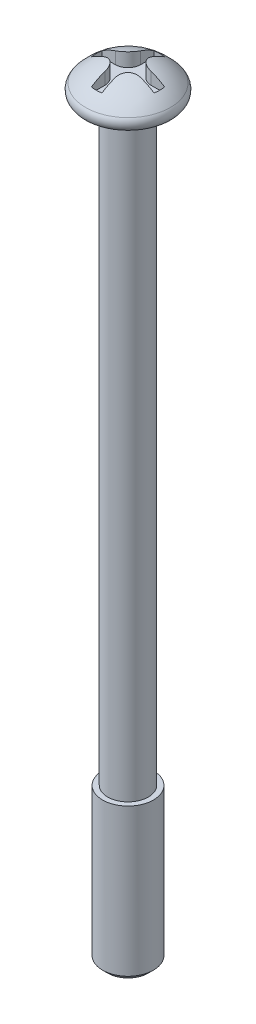
ISO-10303-21;
HEADER;
FILE_DESCRIPTION(('STEP AP214'),'2;1');
FILE_NAME('part.step','',(''),(''),'','','');
FILE_SCHEMA(('AUTOMOTIVE_DESIGN { 1 0 10303 214 1 1 1 1 }'));
ENDSEC;
DATA;
#1=APPLICATION_CONTEXT('core data for automotive mechanical design processes');
#2=APPLICATION_PROTOCOL_DEFINITION('international standard','automotive_design',2000,#1);
#3=PRODUCT_CONTEXT('',#1,'mechanical');
#4=PRODUCT('Part','Part','',(#3));
#5=PRODUCT_RELATED_PRODUCT_CATEGORY('part','',(#4));
#6=PRODUCT_DEFINITION_FORMATION('','',#4);
#7=PRODUCT_DEFINITION_CONTEXT('part definition',#1,'design');
#8=PRODUCT_DEFINITION('design','',#6,#7);
#9=PRODUCT_DEFINITION_SHAPE('','',#8);
#10=(LENGTH_UNIT() NAMED_UNIT(*) SI_UNIT(.MILLI.,.METRE.));
#11=(NAMED_UNIT(*) PLANE_ANGLE_UNIT() SI_UNIT($,.RADIAN.));
#12=(NAMED_UNIT(*) SI_UNIT($,.STERADIAN.) SOLID_ANGLE_UNIT());
#13=UNCERTAINTY_MEASURE_WITH_UNIT(LENGTH_MEASURE(1.E-05),#10,'distance_accuracy_value','');
#14=(GEOMETRIC_REPRESENTATION_CONTEXT(3) GLOBAL_UNCERTAINTY_ASSIGNED_CONTEXT((#13)) GLOBAL_UNIT_ASSIGNED_CONTEXT((#10,
#11,#12)) REPRESENTATION_CONTEXT('',''));
#15=CARTESIAN_POINT('',(0.,0.,0.));
#16=DIRECTION('',(0.,0.,1.));
#17=DIRECTION('',(1.,0.,0.));
#18=AXIS2_PLACEMENT_3D('',#15,#16,#17);
#19=CARTESIAN_POINT('',(0.,0.6,0.));
#20=DIRECTION('',(0.,-1.,0.));
#21=DIRECTION('',(0.,0.,-1.));
#22=AXIS2_PLACEMENT_3D('',#19,#20,#21);
#23=PLANE('',#22);
#24=DIRECTION('',(0.,0.,1.));
#25=VECTOR('',#24,1.);
#26=CARTESIAN_POINT('',(-0.2071067811865,0.6,1.232723318992));
#27=LINE('',#26,#25);
#28=CARTESIAN_POINT('',(-0.2071067811865,0.6,0.7071067811865));
#29=VERTEX_POINT('',#28);
#30=CARTESIAN_POINT('',(-0.2071067811865,0.6,1.23272331899198));
#31=VERTEX_POINT('',#30);
#32=EDGE_CURVE('E161',#29,#31,#27,.T.);
#33=ORIENTED_EDGE('',*,*,#32,.T.);
#34=CARTESIAN_POINT('',(0.,0.6,0.));
#35=DIRECTION('',(0.,-1.,0.));
#36=DIRECTION('',(0.,0.,-1.));
#37=AXIS2_PLACEMENT_3D('',#34,#35,#36);
#38=CIRCLE('',#37,1.25);
#39=CARTESIAN_POINT('',(0.207106781186497,0.6,1.23272331899197));
#40=VERTEX_POINT('',#39);
#41=EDGE_CURVE('E243',#31,#40,#38,.F.);
#42=ORIENTED_EDGE('',*,*,#41,.T.);
#43=DIRECTION('',(0.,0.,-1.));
#44=VECTOR('',#43,1.);
#45=CARTESIAN_POINT('',(0.2071067811865,0.6,0.7071067811865));
#46=LINE('',#45,#44);
#47=CARTESIAN_POINT('',(0.2071067811865,0.6,0.7071067811865));
#48=VERTEX_POINT('',#47);
#49=EDGE_CURVE('E165',#40,#48,#46,.T.);
#50=ORIENTED_EDGE('',*,*,#49,.T.);
#51=CARTESIAN_POINT('',(0.7071067811865,0.6,0.7071067811865));
#52=DIRECTION('',(0.,-1.,0.));
#53=DIRECTION('',(0.,0.,-1.));
#54=AXIS2_PLACEMENT_3D('',#51,#52,#53);
#55=CIRCLE('',#54,0.5);
#56=CARTESIAN_POINT('',(0.7071067811865,0.6,0.2071067811865));
#57=VERTEX_POINT('',#56);
#58=EDGE_CURVE('E168',#57,#48,#55,.F.);
#59=ORIENTED_EDGE('',*,*,#58,.F.);
#60=DIRECTION('',(1.,0.,0.));
#61=VECTOR('',#60,1.);
#62=CARTESIAN_POINT('',(1.232723318992,0.6,0.2071067811865));
#63=LINE('',#62,#61);
#64=CARTESIAN_POINT('',(1.23272331899198,0.6,0.2071067811865));
#65=VERTEX_POINT('',#64);
#66=EDGE_CURVE('E169',#57,#65,#63,.T.);
#67=ORIENTED_EDGE('',*,*,#66,.T.);
#68=CARTESIAN_POINT('',(0.,0.6,0.));
#69=DIRECTION('',(0.,-1.,0.));
#70=DIRECTION('',(0.,0.,-1.));
#71=AXIS2_PLACEMENT_3D('',#68,#69,#70);
#72=CIRCLE('',#71,1.25);
#73=CARTESIAN_POINT('',(1.23272331899197,0.6,-0.207106781186497));
#74=VERTEX_POINT('',#73);
#75=EDGE_CURVE('E254',#65,#74,#72,.F.);
#76=ORIENTED_EDGE('',*,*,#75,.T.);
#77=DIRECTION('',(-1.,0.,0.));
#78=VECTOR('',#77,1.);
#79=CARTESIAN_POINT('',(0.7071067811865,0.6,-0.2071067811865));
#80=LINE('',#79,#78);
#81=CARTESIAN_POINT('',(0.7071067811865,0.6,-0.2071067811865));
#82=VERTEX_POINT('',#81);
#83=EDGE_CURVE('E174',#74,#82,#80,.T.);
#84=ORIENTED_EDGE('',*,*,#83,.T.);
#85=CARTESIAN_POINT('',(0.7071067811865,0.6,-0.7071067811865));
#86=DIRECTION('',(0.,-1.,0.));
#87=DIRECTION('',(0.,0.,-1.));
#88=AXIS2_PLACEMENT_3D('',#85,#86,#87);
#89=CIRCLE('',#88,0.5);
#90=CARTESIAN_POINT('',(0.2071067811865,0.6,-0.7071067811865));
#91=VERTEX_POINT('',#90);
#92=EDGE_CURVE('E177',#91,#82,#89,.F.);
#93=ORIENTED_EDGE('',*,*,#92,.F.);
#94=DIRECTION('',(0.,0.,-1.));
#95=VECTOR('',#94,1.);
#96=CARTESIAN_POINT('',(0.2071067811865,0.6,-1.232723318992));
#97=LINE('',#96,#95);
#98=CARTESIAN_POINT('',(0.2071067811865,0.6,-1.23272331899198));
#99=VERTEX_POINT('',#98);
#100=EDGE_CURVE('E179',#91,#99,#97,.T.);
#101=ORIENTED_EDGE('',*,*,#100,.T.);
#102=CARTESIAN_POINT('',(0.,0.6,0.));
#103=DIRECTION('',(0.,-1.,0.));
#104=DIRECTION('',(0.,0.,-1.));
#105=AXIS2_PLACEMENT_3D('',#102,#103,#104);
#106=CIRCLE('',#105,1.25);
#107=CARTESIAN_POINT('',(-0.207106781186498,0.6,-1.23272331899197));
#108=VERTEX_POINT('',#107);
#109=EDGE_CURVE('E137',#99,#108,#106,.F.);
#110=ORIENTED_EDGE('',*,*,#109,.T.);
#111=DIRECTION('',(0.,0.,1.));
#112=VECTOR('',#111,1.);
#113=CARTESIAN_POINT('',(-0.2071067811865,0.6,-0.7071067811865));
#114=LINE('',#113,#112);
#115=CARTESIAN_POINT('',(-0.2071067811865,0.6,-0.7071067811865));
#116=VERTEX_POINT('',#115);
#117=EDGE_CURVE('E133',#108,#116,#114,.T.);
#118=ORIENTED_EDGE('',*,*,#117,.T.);
#119=CARTESIAN_POINT('',(-0.7071067811865,0.6,-0.7071067811865));
#120=DIRECTION('',(0.,-1.,0.));
#121=DIRECTION('',(0.,0.,-1.));
#122=AXIS2_PLACEMENT_3D('',#119,#120,#121);
#123=CIRCLE('',#122,0.5);
#124=CARTESIAN_POINT('',(-0.7071067811865,0.6,-0.2071067811865));
#125=VERTEX_POINT('',#124);
#126=EDGE_CURVE('E20',#125,#116,#123,.F.);
#127=ORIENTED_EDGE('',*,*,#126,.F.);
#128=DIRECTION('',(-1.,0.,0.));
#129=VECTOR('',#128,1.);
#130=CARTESIAN_POINT('',(-1.232723318992,0.6,-0.2071067811865));
#131=LINE('',#130,#129);
#132=CARTESIAN_POINT('',(-1.23272331899197,0.6,-0.207106781186497));
#133=VERTEX_POINT('',#132);
#134=EDGE_CURVE('E128',#125,#133,#131,.T.);
#135=ORIENTED_EDGE('',*,*,#134,.T.);
#136=CARTESIAN_POINT('',(0.,0.6,0.));
#137=DIRECTION('',(0.,-1.,0.));
#138=DIRECTION('',(0.,0.,-1.));
#139=AXIS2_PLACEMENT_3D('',#136,#137,#138);
#140=CIRCLE('',#139,1.25);
#141=CARTESIAN_POINT('',(-1.23272331899198,0.6,0.2071067811865));
#142=VERTEX_POINT('',#141);
#143=EDGE_CURVE('E251',#133,#142,#140,.F.);
#144=ORIENTED_EDGE('',*,*,#143,.T.);
#145=DIRECTION('',(1.,0.,0.));
#146=VECTOR('',#145,1.);
#147=CARTESIAN_POINT('',(-0.7071067811865,0.6,0.2071067811865));
#148=LINE('',#147,#146);
#149=CARTESIAN_POINT('',(-0.7071067811865,0.6,0.2071067811865));
#150=VERTEX_POINT('',#149);
#151=EDGE_CURVE('E158',#142,#150,#148,.T.);
#152=ORIENTED_EDGE('',*,*,#151,.T.);
#153=CARTESIAN_POINT('',(-0.7071067811865,0.6,0.7071067811865));
#154=DIRECTION('',(0.,-1.,0.));
#155=DIRECTION('',(0.,0.,-1.));
#156=AXIS2_PLACEMENT_3D('',#153,#154,#155);
#157=CIRCLE('',#156,0.5);
#158=EDGE_CURVE('E237',#29,#150,#157,.F.);
#159=ORIENTED_EDGE('',*,*,#158,.F.);
#160=EDGE_LOOP('',(#33,#42,#50,#59,#67,#76,#84,#93,#101,#110,#118,#127,#135,#144,#152,#159));
#161=FACE_BOUND('',#160,.T.);
#162=ADVANCED_FACE('F17',(#161),#23,.F.);
#163=CARTESIAN_POINT('',(0.,-29.5,0.));
#164=DIRECTION('',(0.,-1.,0.));
#165=DIRECTION('',(0.,0.,-1.));
#166=AXIS2_PLACEMENT_3D('',#163,#164,#165);
#167=PLANE('',#166);
#168=CARTESIAN_POINT('',(0.,-29.4999999999845,0.));
#169=DIRECTION('',(0.,1.,0.));
#170=DIRECTION('',(0.,0.,1.));
#171=AXIS2_PLACEMENT_3D('',#168,#169,#170);
#172=CIRCLE('',#171,0.800000000026557);
#173=CARTESIAN_POINT('',(0.,-29.4999999999845,0.800000000026557));
#174=VERTEX_POINT('',#173);
#175=EDGE_CURVE('E234',#174,#174,#172,.T.);
#176=ORIENTED_EDGE('',*,*,#175,.F.);
#177=EDGE_LOOP('',(#176));
#178=FACE_BOUND('',#177,.T.);
#179=ADVANCED_FACE('F298',(#178),#167,.T.);
#180=CARTESIAN_POINT('',(-1.232723318992,0.6,-0.2071067811865));
#181=DIRECTION('',(0.,0.,-1.));
#182=DIRECTION('',(-1.,0.,0.));
#183=AXIS2_PLACEMENT_3D('',#180,#181,#182);
#184=PLANE('',#183);
#185=ORIENTED_EDGE('',*,*,#134,.F.);
#186=DIRECTION('',(0.,-1.,0.));
#187=VECTOR('',#186,1.);
#188=CARTESIAN_POINT('',(-0.7071067811865,0.6,-0.2071067811865));
#189=LINE('',#188,#187);
#190=CARTESIAN_POINT('',(-0.707106781186498,1.072946400944,-0.2071067811865));
#191=VERTEX_POINT('',#190);
#192=EDGE_CURVE('E147',#191,#125,#189,.T.);
#193=ORIENTED_EDGE('',*,*,#192,.F.);
#194=CARTESIAN_POINT('',(-1.23272331899196,0.810386699023168,-0.2071067811865));
#195=CARTESIAN_POINT('',(-1.20557091875396,0.82887587654213,-0.2071067811865));
#196=CARTESIAN_POINT('',(-1.17800202853966,0.846753291703225,-0.2071067811865));
#197=CARTESIAN_POINT('',(-1.12220017955182,0.881181384346634,-0.2071067811865));
#198=CARTESIAN_POINT('',(-1.09397031989606,0.897737085070877,-0.2071067811865));
#199=CARTESIAN_POINT('',(-1.03685453980652,0.92953512182929,-0.2071067811865));
#200=CARTESIAN_POINT('',(-1.00797004904037,0.944780025871327,-0.2071067811865));
#201=CARTESIAN_POINT('',(-0.949548383728813,0.973963230596895,-0.2071067811865));
#202=CARTESIAN_POINT('',(-0.920011209183401,0.987901531280427,-0.2071067811865));
#203=CARTESIAN_POINT('',(-0.860283187710455,1.01447013922012,-0.2071067811865));
#204=CARTESIAN_POINT('',(-0.830091146209189,1.02709776103264,-0.2071067811865));
#205=CARTESIAN_POINT('',(-0.769049428807063,1.0510361956123,-0.2071067811865));
#206=CARTESIAN_POINT('',(-0.738197597941195,1.06234151350761,-0.2071067811865));
#207=CARTESIAN_POINT('',(-0.707106781186496,1.07294640094399,-0.2071067811865));
#208=B_SPLINE_CURVE_WITH_KNOTS('',3,(#194,#195,#196,#197,#198,#199,#200,#201,#202,#203,#204,
#205,#206,#207),.UNSPECIFIED.,.F.,.F.,(4,2,2,2,2,2,4),(0.,0.0985406624340739,0.196686968259895,
0.29463639109811,0.392585813936324,0.490732119762145,0.589272782196219),.UNSPECIFIED.);
#209=CARTESIAN_POINT('',(-1.23272331899197,0.810386699023184,-0.207106781186497));
#210=VERTEX_POINT('',#209);
#211=EDGE_CURVE('E285',#210,#191,#208,.T.);
#212=ORIENTED_EDGE('',*,*,#211,.F.);
#213=DIRECTION('',(0.,-1.,0.));
#214=VECTOR('',#213,1.);
#215=CARTESIAN_POINT('',(-1.23272331899197,0.6,-0.207106781186494));
#216=LINE('',#215,#214);
#217=EDGE_CURVE('E249',#210,#133,#216,.T.);
#218=ORIENTED_EDGE('',*,*,#217,.T.);
#219=EDGE_LOOP('',(#185,#193,#212,#218));
#220=FACE_BOUND('',#219,.T.);
#221=ADVANCED_FACE('F294',(#220),#184,.F.);
#222=CARTESIAN_POINT('',(-0.7071067811865,0.6,-0.7071067811865));
#223=DIRECTION('',(0.,-1.,0.));
#224=DIRECTION('',(0.,0.,-1.));
#225=AXIS2_PLACEMENT_3D('',#222,#223,#224);
#226=CYLINDRICAL_SURFACE('',#225,0.5);
#227=DIRECTION('',(0.,1.,0.));
#228=VECTOR('',#227,1.);
#229=CARTESIAN_POINT('',(-0.2071067811865,0.6,-0.7071067811865));
#230=LINE('',#229,#228);
#231=CARTESIAN_POINT('',(-0.2071067811865,1.07294640094399,-0.7071067811865));
#232=VERTEX_POINT('',#231);
#233=EDGE_CURVE('E141',#116,#232,#230,.T.);
#234=ORIENTED_EDGE('',*,*,#233,.T.);
#235=CARTESIAN_POINT('',(-0.707106781186496,1.07294640094399,-0.2071067811865));
#236=CARTESIAN_POINT('',(-0.681032109450156,1.08184936360615,-0.207081070804154));
#237=CARTESIAN_POINT('',(-0.654692789517907,1.09007217090469,-0.209146462423067));
#238=CARTESIAN_POINT('',(-0.602189232256978,1.10494894996213,-0.217521272326538));
#239=CARTESIAN_POINT('',(-0.576025489745097,1.11159952945094,-0.223839756253361));
#240=CARTESIAN_POINT('',(-0.524628426984167,1.12309832810892,-0.240805293811514));
#241=CARTESIAN_POINT('',(-0.499397716757144,1.12794179197718,-0.251463615613742));
#242=CARTESIAN_POINT('',(-0.450815555702145,1.13561433951421,-0.27691489764956));
#243=CARTESIAN_POINT('',(-0.42746171658236,1.13844602033163,-0.291702492619723));
#244=CARTESIAN_POINT('',(-0.384547250326186,1.14189822875947,-0.324168044392469));
#245=CARTESIAN_POINT('',(-0.364853574984726,1.14262462173255,-0.341659072391159));
#246=CARTESIAN_POINT('',(-0.328471063683956,1.14214199428963,-0.379503871531294));
#247=CARTESIAN_POINT('',(-0.311781927814025,1.14093316716497,-0.399857356583008));
#248=CARTESIAN_POINT('',(-0.282299252442733,1.1366874239885,-0.442181931986336));
#249=CARTESIAN_POINT('',(-0.269409322094451,1.13370289745833,-0.464091400572117));
#250=CARTESIAN_POINT('',(-0.247169371381563,1.12605008214753,-0.50938228019127));
#251=CARTESIAN_POINT('',(-0.237822286057971,1.1213804035403,-0.532764893020356));
#252=CARTESIAN_POINT('',(-0.222515268127987,1.11029409519183,-0.581246396907824));
#253=CARTESIAN_POINT('',(-0.216699862381791,1.10381703937803,-0.606376700234224));
#254=CARTESIAN_POINT('',(-0.208987376830147,1.08941617116049,-0.656788214834921));
#255=CARTESIAN_POINT('',(-0.207084783049661,1.0814944118223,-0.682069163327835));
#256=CARTESIAN_POINT('',(-0.2071067811865,1.07294640094399,-0.707106781186496));
#257=B_SPLINE_CURVE_WITH_KNOTS('',3,(#235,#236,#237,#238,#239,#240,#241,#242,#243,#244,#245,
#246,#247,#248,#249,#250,#251,#252,#253,#254,#255,#256),.UNSPECIFIED.,.F.,.F.,(4,2,2,2,2,2,2,2,
2,2,4),(0.,0.0826173206247365,0.165411303498771,0.248421641687185,0.331324620447903,
0.409979626547998,0.488626777012635,0.565061216509943,0.641558839808856,0.721006589793719,
0.800342304257926),.UNSPECIFIED.);
#258=EDGE_CURVE('E276',#191,#232,#257,.T.);
#259=ORIENTED_EDGE('',*,*,#258,.F.);
#260=ORIENTED_EDGE('',*,*,#192,.T.);
#261=ORIENTED_EDGE('',*,*,#126,.T.);
#262=EDGE_LOOP('',(#234,#259,#260,#261));
#263=FACE_BOUND('',#262,.T.);
#264=ADVANCED_FACE('F144',(#263),#226,.T.);
#265=CARTESIAN_POINT('',(-0.2071067811865,0.6,-0.7071067811865));
#266=DIRECTION('',(-1.,0.,0.));
#267=DIRECTION('',(0.,0.,1.));
#268=AXIS2_PLACEMENT_3D('',#265,#266,#267);
#269=PLANE('',#268);
#270=ORIENTED_EDGE('',*,*,#117,.F.);
#271=DIRECTION('',(0.,-1.,0.));
#272=VECTOR('',#271,1.);
#273=CARTESIAN_POINT('',(-0.207106781186495,0.6,-1.23272331899197));
#274=LINE('',#273,#272);
#275=CARTESIAN_POINT('',(-0.2071067811865,0.810386699023183,-1.23272331899195));
#276=VERTEX_POINT('',#275);
#277=EDGE_CURVE('E153',#108,#276,#274,.F.);
#278=ORIENTED_EDGE('',*,*,#277,.T.);
#279=CARTESIAN_POINT('',(-0.2071067811865,-1.,0.));
#280=DIRECTION('',(-1.,0.,0.));
#281=DIRECTION('',(0.,0.,1.));
#282=AXIS2_PLACEMENT_3D('',#279,#280,#281);
#283=CIRCLE('',#282,2.19022984665687);
#284=EDGE_CURVE('E150',#232,#276,#283,.T.);
#285=ORIENTED_EDGE('',*,*,#284,.F.);
#286=ORIENTED_EDGE('',*,*,#233,.F.);
#287=EDGE_LOOP('',(#270,#278,#285,#286));
#288=FACE_BOUND('',#287,.T.);
#289=ADVANCED_FACE('F148',(#288),#269,.F.);
#290=CARTESIAN_POINT('',(0.,0.6,0.));
#291=DIRECTION('',(0.,-1.,0.));
#292=DIRECTION('',(0.,0.,-1.));
#293=AXIS2_PLACEMENT_3D('',#290,#291,#292);
#294=CYLINDRICAL_SURFACE('',#293,1.25);
#295=ORIENTED_EDGE('',*,*,#109,.F.);
#296=DIRECTION('',(0.,1.,0.));
#297=VECTOR('',#296,1.);
#298=CARTESIAN_POINT('',(0.2071067811865,0.6,-1.232723318992));
#299=LINE('',#298,#297);
#300=CARTESIAN_POINT('',(0.2071067811865,0.810386699023172,-1.23272331899197));
#301=VERTEX_POINT('',#300);
#302=EDGE_CURVE('E180',#99,#301,#299,.T.);
#303=ORIENTED_EDGE('',*,*,#302,.T.);
#304=CARTESIAN_POINT('',(0.,0.8103866990232,0.));
#305=DIRECTION('',(0.,-1.,0.));
#306=DIRECTION('',(0.,0.,-1.));
#307=AXIS2_PLACEMENT_3D('',#304,#305,#306);
#308=CIRCLE('',#307,1.25);
#309=EDGE_CURVE('E264',#276,#301,#308,.T.);
#310=ORIENTED_EDGE('',*,*,#309,.F.);
#311=ORIENTED_EDGE('',*,*,#277,.F.);
#312=EDGE_LOOP('',(#295,#303,#310,#311));
#313=FACE_BOUND('',#312,.T.);
#314=ADVANCED_FACE('F262',(#313),#294,.F.);
#315=CARTESIAN_POINT('',(0.2071067811865,0.6,-1.232723318992));
#316=DIRECTION('',(1.,0.,0.));
#317=DIRECTION('',(0.,0.,-1.));
#318=AXIS2_PLACEMENT_3D('',#315,#316,#317);
#319=PLANE('',#318);
#320=ORIENTED_EDGE('',*,*,#100,.F.);
#321=DIRECTION('',(0.,-1.,0.));
#322=VECTOR('',#321,1.);
#323=CARTESIAN_POINT('',(0.2071067811865,0.6,-0.7071067811865));
#324=LINE('',#323,#322);
#325=CARTESIAN_POINT('',(0.2071067811865,1.07294640094399,-0.7071067811865));
#326=VERTEX_POINT('',#325);
#327=EDGE_CURVE('E256',#326,#91,#324,.T.);
#328=ORIENTED_EDGE('',*,*,#327,.F.);
#329=CARTESIAN_POINT('',(0.2071067811865,-1.,0.));
#330=DIRECTION('',(-1.,0.,0.));
#331=DIRECTION('',(0.,0.,1.));
#332=AXIS2_PLACEMENT_3D('',#329,#330,#331);
#333=CIRCLE('',#332,2.19022984665687);
#334=EDGE_CURVE('E267',#301,#326,#333,.F.);
#335=ORIENTED_EDGE('',*,*,#334,.F.);
#336=ORIENTED_EDGE('',*,*,#302,.F.);
#337=EDGE_LOOP('',(#320,#328,#335,#336));
#338=FACE_BOUND('',#337,.T.);
#339=ADVANCED_FACE('F268',(#338),#319,.F.);
#340=CARTESIAN_POINT('',(0.7071067811865,0.6,-0.7071067811865));
#341=DIRECTION('',(0.,-1.,0.));
#342=DIRECTION('',(0.,0.,-1.));
#343=AXIS2_PLACEMENT_3D('',#340,#341,#342);
#344=CYLINDRICAL_SURFACE('',#343,0.5);
#345=DIRECTION('',(0.,1.,0.));
#346=VECTOR('',#345,1.);
#347=CARTESIAN_POINT('',(0.7071067811865,0.6,-0.2071067811865));
#348=LINE('',#347,#346);
#349=CARTESIAN_POINT('',(0.707106781186498,1.072946400944,-0.2071067811865));
#350=VERTEX_POINT('',#349);
#351=EDGE_CURVE('E176',#82,#350,#348,.T.);
#352=ORIENTED_EDGE('',*,*,#351,.T.);
#353=CARTESIAN_POINT('',(0.2071067811865,1.07294640094399,-0.707106781186496));
#354=CARTESIAN_POINT('',(0.207081070804154,1.08184936360616,-0.681032109450141));
#355=CARTESIAN_POINT('',(0.209146462423069,1.0900721709047,-0.654692789517877));
#356=CARTESIAN_POINT('',(0.21752127232655,1.10494894996215,-0.602189232256918));
#357=CARTESIAN_POINT('',(0.22383975625338,1.11159952945095,-0.576025489745022));
#358=CARTESIAN_POINT('',(0.240805293811553,1.12309832810894,-0.524628426984064));
#359=CARTESIAN_POINT('',(0.251463615613793,1.1279417919772,-0.499397716757028));
#360=CARTESIAN_POINT('',(0.276914897649641,1.13561433951423,-0.450815555702008));
#361=CARTESIAN_POINT('',(0.291702492619821,1.13844602033164,-0.427461716582213));
#362=CARTESIAN_POINT('',(0.324168044392593,1.14189822875948,-0.384547250326039));
#363=CARTESIAN_POINT('',(0.341659072391289,1.14262462173256,-0.364853574984587));
#364=CARTESIAN_POINT('',(0.379503871531435,1.14214199428962,-0.328471063683833));
#365=CARTESIAN_POINT('',(0.399857356583154,1.14093316716496,-0.311781927813911));
#366=CARTESIAN_POINT('',(0.442181931986491,1.13668742398848,-0.282299252442636));
#367=CARTESIAN_POINT('',(0.464091400572276,1.1337028974583,-0.269409322094362));
#368=CARTESIAN_POINT('',(0.509382280191437,1.1260500821475,-0.247169371381491));
#369=CARTESIAN_POINT('',(0.532764893020525,1.12138040354027,-0.237822286057909));
#370=CARTESIAN_POINT('',(0.581246396907969,1.11029409519179,-0.222515268127952));
#371=CARTESIAN_POINT('',(0.606376700234341,1.103817039378,-0.216699862381768));
#372=CARTESIAN_POINT('',(0.65678821483498,1.08941617116047,-0.208987376830143));
#373=CARTESIAN_POINT('',(0.682069163327864,1.08149441182229,-0.207084783049661));
#374=CARTESIAN_POINT('',(0.707106781186497,1.07294640094399,-0.2071067811865));
#375=B_SPLINE_CURVE_WITH_KNOTS('',3,(#353,#354,#355,#356,#357,#358,#359,#360,#361,#362,#363,
#364,#365,#366,#367,#368,#369,#370,#371,#372,#373,#374),.UNSPECIFIED.,.F.,.F.,(4,2,2,2,2,2,2,2,
2,2,4),(0.,0.0826173206247837,0.165411303498866,0.248421641687329,0.331324620448095,
0.409979626548186,0.488626777012818,0.565061216510127,0.641558839809039,0.721006589793811,
0.800342304257926),.UNSPECIFIED.);
#376=EDGE_CURVE('E272',#326,#350,#375,.T.);
#377=ORIENTED_EDGE('',*,*,#376,.F.);
#378=ORIENTED_EDGE('',*,*,#327,.T.);
#379=ORIENTED_EDGE('',*,*,#92,.T.);
#380=EDGE_LOOP('',(#352,#377,#378,#379));
#381=FACE_BOUND('',#380,.T.);
#382=ADVANCED_FACE('F354',(#381),#344,.T.);
#383=CARTESIAN_POINT('',(0.7071067811865,0.6,-0.2071067811865));
#384=DIRECTION('',(0.,0.,-1.));
#385=DIRECTION('',(-1.,0.,0.));
#386=AXIS2_PLACEMENT_3D('',#383,#384,#385);
#387=PLANE('',#386);
#388=ORIENTED_EDGE('',*,*,#83,.F.);
#389=DIRECTION('',(0.,-1.,0.));
#390=VECTOR('',#389,1.);
#391=CARTESIAN_POINT('',(1.23272331899197,0.6,-0.207106781186495));
#392=LINE('',#391,#390);
#393=CARTESIAN_POINT('',(1.23272331899197,0.8103866990232,-0.207106781186497));
#394=VERTEX_POINT('',#393);
#395=EDGE_CURVE('E173',#74,#394,#392,.F.);
#396=ORIENTED_EDGE('',*,*,#395,.T.);
#397=CARTESIAN_POINT('',(0.707106781186497,1.07294640094399,-0.2071067811865));
#398=CARTESIAN_POINT('',(0.738197597941195,1.06234151350761,-0.2071067811865));
#399=CARTESIAN_POINT('',(0.769049428807063,1.0510361956123,-0.2071067811865));
#400=CARTESIAN_POINT('',(0.830091146209189,1.02709776103264,-0.2071067811865));
#401=CARTESIAN_POINT('',(0.860283187710455,1.01447013922012,-0.2071067811865));
#402=CARTESIAN_POINT('',(0.920011209183402,0.987901531280427,-0.2071067811865));
#403=CARTESIAN_POINT('',(0.949548383728813,0.973963230596895,-0.2071067811865));
#404=CARTESIAN_POINT('',(1.00797004904037,0.944780025871326,-0.2071067811865));
#405=CARTESIAN_POINT('',(1.03685453980652,0.92953512182929,-0.2071067811865));
#406=CARTESIAN_POINT('',(1.09397031989606,0.897737085070877,-0.2071067811865));
#407=CARTESIAN_POINT('',(1.12220017955182,0.881181384346634,-0.2071067811865));
#408=CARTESIAN_POINT('',(1.17800202853966,0.846753291703224,-0.2071067811865));
#409=CARTESIAN_POINT('',(1.20557091875396,0.82887587654213,-0.2071067811865));
#410=CARTESIAN_POINT('',(1.23272331899196,0.810386699023168,-0.207106781186499));
#411=B_SPLINE_CURVE_WITH_KNOTS('',3,(#397,#398,#399,#400,#401,#402,#403,#404,#405,#406,#407,
#408,#409,#410),.UNSPECIFIED.,.F.,.F.,(4,2,2,2,2,2,4),(0.,0.0985406624340736,0.196686968259895,
0.294636391098109,0.392585813936324,0.490732119762145,0.589272782196219),.UNSPECIFIED.);
#412=EDGE_CURVE('E361',#350,#394,#411,.T.);
#413=ORIENTED_EDGE('',*,*,#412,.F.);
#414=ORIENTED_EDGE('',*,*,#351,.F.);
#415=EDGE_LOOP('',(#388,#396,#413,#414));
#416=FACE_BOUND('',#415,.T.);
#417=ADVANCED_FACE('F358',(#416),#387,.F.);
#418=CARTESIAN_POINT('',(0.,0.6,0.));
#419=DIRECTION('',(0.,-1.,0.));
#420=DIRECTION('',(0.,0.,-1.));
#421=AXIS2_PLACEMENT_3D('',#418,#419,#420);
#422=CYLINDRICAL_SURFACE('',#421,1.25);
#423=ORIENTED_EDGE('',*,*,#143,.F.);
#424=ORIENTED_EDGE('',*,*,#217,.F.);
#425=CARTESIAN_POINT('',(0.,0.8103866990232,0.));
#426=DIRECTION('',(0.,-1.,0.));
#427=DIRECTION('',(0.,0.,-1.));
#428=AXIS2_PLACEMENT_3D('',#425,#426,#427);
#429=CIRCLE('',#428,1.25);
#430=CARTESIAN_POINT('',(-1.23272331899198,0.8103866990232,0.2071067811865));
#431=VERTEX_POINT('',#430);
#432=EDGE_CURVE('E363',#431,#210,#429,.T.);
#433=ORIENTED_EDGE('',*,*,#432,.F.);
#434=DIRECTION('',(0.,1.,0.));
#435=VECTOR('',#434,1.);
#436=CARTESIAN_POINT('',(-1.232723318992,0.6,0.2071067811865));
#437=LINE('',#436,#435);
#438=EDGE_CURVE('E160',#431,#142,#437,.F.);
#439=ORIENTED_EDGE('',*,*,#438,.T.);
#440=EDGE_LOOP('',(#423,#424,#433,#439));
#441=FACE_BOUND('',#440,.T.);
#442=ADVANCED_FACE('F439',(#441),#422,.F.);
#443=CARTESIAN_POINT('',(0.,0.6,0.));
#444=DIRECTION('',(0.,-1.,0.));
#445=DIRECTION('',(0.,0.,-1.));
#446=AXIS2_PLACEMENT_3D('',#443,#444,#445);
#447=CYLINDRICAL_SURFACE('',#446,1.25);
#448=ORIENTED_EDGE('',*,*,#395,.F.);
#449=ORIENTED_EDGE('',*,*,#75,.F.);
#450=DIRECTION('',(0.,1.,0.));
#451=VECTOR('',#450,1.);
#452=CARTESIAN_POINT('',(1.232723318992,0.6,0.2071067811865));
#453=LINE('',#452,#451);
#454=CARTESIAN_POINT('',(1.23272331899198,0.810386699023182,0.2071067811865));
#455=VERTEX_POINT('',#454);
#456=EDGE_CURVE('E172',#65,#455,#453,.T.);
#457=ORIENTED_EDGE('',*,*,#456,.T.);
#458=CARTESIAN_POINT('',(0.,0.8103866990232,0.));
#459=DIRECTION('',(0.,-1.,0.));
#460=DIRECTION('',(0.,0.,-1.));
#461=AXIS2_PLACEMENT_3D('',#458,#459,#460);
#462=CIRCLE('',#461,1.25);
#463=EDGE_CURVE('E588',#394,#455,#462,.T.);
#464=ORIENTED_EDGE('',*,*,#463,.F.);
#465=EDGE_LOOP('',(#448,#449,#457,#464));
#466=FACE_BOUND('',#465,.T.);
#467=ADVANCED_FACE('F446',(#466),#447,.F.);
#468=CARTESIAN_POINT('',(1.232723318992,0.6,0.2071067811865));
#469=DIRECTION('',(0.,0.,1.));
#470=DIRECTION('',(1.,0.,0.));
#471=AXIS2_PLACEMENT_3D('',#468,#469,#470);
#472=PLANE('',#471);
#473=ORIENTED_EDGE('',*,*,#66,.F.);
#474=DIRECTION('',(0.,-1.,0.));
#475=VECTOR('',#474,1.);
#476=CARTESIAN_POINT('',(0.7071067811865,0.6,0.2071067811865));
#477=LINE('',#476,#475);
#478=CARTESIAN_POINT('',(0.707106781186498,1.072946400944,0.2071067811865));
#479=VERTEX_POINT('',#478);
#480=EDGE_CURVE('E245',#479,#57,#477,.T.);
#481=ORIENTED_EDGE('',*,*,#480,.F.);
#482=CARTESIAN_POINT('',(1.23272331899197,0.810386699023165,0.2071067811865));
#483=CARTESIAN_POINT('',(1.20557091875396,0.828875876542126,0.2071067811865));
#484=CARTESIAN_POINT('',(1.17800202853966,0.846753291703221,0.2071067811865));
#485=CARTESIAN_POINT('',(1.12220017955182,0.881181384346632,0.2071067811865));
#486=CARTESIAN_POINT('',(1.09397031989606,0.897737085070875,0.2071067811865));
#487=CARTESIAN_POINT('',(1.03685453980653,0.929535121829288,0.2071067811865));
#488=CARTESIAN_POINT('',(1.00797004904038,0.944780025871325,0.2071067811865));
#489=CARTESIAN_POINT('',(0.949548383728815,0.973963230596894,0.2071067811865));
#490=CARTESIAN_POINT('',(0.920011209183404,0.987901531280426,0.2071067811865));
#491=CARTESIAN_POINT('',(0.860283187710457,1.01447013922012,0.2071067811865));
#492=CARTESIAN_POINT('',(0.83009114620919,1.02709776103264,0.2071067811865));
#493=CARTESIAN_POINT('',(0.769049428807064,1.0510361956123,0.2071067811865));
#494=CARTESIAN_POINT('',(0.738197597941195,1.06234151350761,0.2071067811865));
#495=CARTESIAN_POINT('',(0.707106781186496,1.07294640094399,0.207106781186501));
#496=B_SPLINE_CURVE_WITH_KNOTS('',3,(#482,#483,#484,#485,#486,#487,#488,#489,#490,#491,#492,
#493,#494,#495),.UNSPECIFIED.,.F.,.F.,(4,2,2,2,2,2,4),(0.,0.0985406624340749,0.196686968259897,
0.294636391098113,0.392585813936328,0.49073211976215,0.589272782196225),.UNSPECIFIED.);
#497=EDGE_CURVE('E587',#455,#479,#496,.T.);
#498=ORIENTED_EDGE('',*,*,#497,.F.);
#499=ORIENTED_EDGE('',*,*,#456,.F.);
#500=EDGE_LOOP('',(#473,#481,#498,#499));
#501=FACE_BOUND('',#500,.T.);
#502=ADVANCED_FACE('F454',(#501),#472,.F.);
#503=CARTESIAN_POINT('',(0.7071067811865,0.6,0.7071067811865));
#504=DIRECTION('',(0.,-1.,0.));
#505=DIRECTION('',(0.,0.,-1.));
#506=AXIS2_PLACEMENT_3D('',#503,#504,#505);
#507=CYLINDRICAL_SURFACE('',#506,0.5);
#508=DIRECTION('',(0.,1.,0.));
#509=VECTOR('',#508,1.);
#510=CARTESIAN_POINT('',(0.2071067811865,0.6,0.7071067811865));
#511=LINE('',#510,#509);
#512=CARTESIAN_POINT('',(0.2071067811865,1.07294640094399,0.707106781186498));
#513=VERTEX_POINT('',#512);
#514=EDGE_CURVE('E167',#48,#513,#511,.T.);
#515=ORIENTED_EDGE('',*,*,#514,.T.);
#516=CARTESIAN_POINT('',(0.707106781186496,1.07294640094399,0.2071067811865));
#517=CARTESIAN_POINT('',(0.681032109450157,1.08184936360615,0.207081070804154));
#518=CARTESIAN_POINT('',(0.654692789517907,1.09007217090469,0.209146462423067));
#519=CARTESIAN_POINT('',(0.602189232256979,1.10494894996213,0.217521272326537));
#520=CARTESIAN_POINT('',(0.576025489745098,1.11159952945094,0.22383975625336));
#521=CARTESIAN_POINT('',(0.524628426984168,1.12309832810892,0.240805293811513));
#522=CARTESIAN_POINT('',(0.499397716757145,1.12794179197718,0.251463615613741));
#523=CARTESIAN_POINT('',(0.450815555702147,1.13561433951421,0.276914897649559));
#524=CARTESIAN_POINT('',(0.427461716582363,1.13844602033163,0.291702492619723));
#525=CARTESIAN_POINT('',(0.384547250326188,1.14189822875948,0.324168044392469));
#526=CARTESIAN_POINT('',(0.364853574984728,1.14262462173255,0.341659072391157));
#527=CARTESIAN_POINT('',(0.328471063683957,1.14214199428963,0.379503871531292));
#528=CARTESIAN_POINT('',(0.311781927814027,1.14093316716497,0.399857356583006));
#529=CARTESIAN_POINT('',(0.282299252442735,1.1366874239885,0.442181931986334));
#530=CARTESIAN_POINT('',(0.269409322094453,1.13370289745833,0.464091400572114));
#531=CARTESIAN_POINT('',(0.247169371381564,1.12605008214753,0.509382280191267));
#532=CARTESIAN_POINT('',(0.237822286057972,1.12138040354031,0.532764893020352));
#533=CARTESIAN_POINT('',(0.222515268127988,1.11029409519183,0.581246396907821));
#534=CARTESIAN_POINT('',(0.216699862381791,1.10381703937803,0.606376700234222));
#535=CARTESIAN_POINT('',(0.208987376830147,1.08941617116049,0.65678821483492));
#536=CARTESIAN_POINT('',(0.207084783049661,1.0814944118223,0.682069163327835));
#537=CARTESIAN_POINT('',(0.207106781186501,1.07294640094399,0.707106781186497));
#538=B_SPLINE_CURVE_WITH_KNOTS('',3,(#516,#517,#518,#519,#520,#521,#522,#523,#524,#525,#526,
#527,#528,#529,#530,#531,#532,#533,#534,#535,#536,#537),.UNSPECIFIED.,.F.,.F.,(4,2,2,2,2,2,2,2,
2,2,4),(0.,0.082617320624736,0.16541130349877,0.248421641687183,0.331324620447901,
0.409979626547996,0.488626777012632,0.56506121650994,0.641558839808852,0.721006589793717,
0.800342304257927),.UNSPECIFIED.);
#539=EDGE_CURVE('E583',#479,#513,#538,.T.);
#540=ORIENTED_EDGE('',*,*,#539,.F.);
#541=ORIENTED_EDGE('',*,*,#480,.T.);
#542=ORIENTED_EDGE('',*,*,#58,.T.);
#543=EDGE_LOOP('',(#515,#540,#541,#542));
#544=FACE_BOUND('',#543,.T.);
#545=ADVANCED_FACE('F463',(#544),#507,.T.);
#546=CARTESIAN_POINT('',(0.2071067811865,0.6,0.7071067811865));
#547=DIRECTION('',(1.,0.,0.));
#548=DIRECTION('',(0.,0.,-1.));
#549=AXIS2_PLACEMENT_3D('',#546,#547,#548);
#550=PLANE('',#549);
#551=ORIENTED_EDGE('',*,*,#49,.F.);
#552=DIRECTION('',(0.,-1.,0.));
#553=VECTOR('',#552,1.);
#554=CARTESIAN_POINT('',(0.207106781186494,0.6,1.23272331899197));
#555=LINE('',#554,#553);
#556=CARTESIAN_POINT('',(0.207106781186497,0.8103866990232,1.23272331899197));
#557=VERTEX_POINT('',#556);
#558=EDGE_CURVE('E164',#40,#557,#555,.F.);
#559=ORIENTED_EDGE('',*,*,#558,.T.);
#560=CARTESIAN_POINT('',(0.207106781186499,1.07294640094399,0.707106781186497));
#561=CARTESIAN_POINT('',(0.2071067811865,1.06234151350761,0.738197597941195));
#562=CARTESIAN_POINT('',(0.2071067811865,1.0510361956123,0.769049428807063));
#563=CARTESIAN_POINT('',(0.2071067811865,1.02709776103264,0.830091146209189));
#564=CARTESIAN_POINT('',(0.2071067811865,1.01447013922012,0.860283187710455));
#565=CARTESIAN_POINT('',(0.2071067811865,0.987901531280426,0.920011209183402));
#566=CARTESIAN_POINT('',(0.2071067811865,0.973963230596895,0.949548383728813));
#567=CARTESIAN_POINT('',(0.2071067811865,0.944780025871327,1.00797004904037));
#568=CARTESIAN_POINT('',(0.2071067811865,0.92953512182929,1.03685453980652));
#569=CARTESIAN_POINT('',(0.2071067811865,0.897737085070877,1.09397031989606));
#570=CARTESIAN_POINT('',(0.2071067811865,0.881181384346634,1.12220017955182));
#571=CARTESIAN_POINT('',(0.2071067811865,0.846753291703224,1.17800202853966));
#572=CARTESIAN_POINT('',(0.2071067811865,0.828875876542129,1.20557091875396));
#573=CARTESIAN_POINT('',(0.2071067811865,0.810386699023168,1.23272331899196));
#574=B_SPLINE_CURVE_WITH_KNOTS('',3,(#560,#561,#562,#563,#564,#565,#566,#567,#568,#569,#570,
#571,#572,#573),.UNSPECIFIED.,.F.,.F.,(4,2,2,2,2,2,4),(0.,0.0985406624340738,0.196686968259895,
0.29463639109811,0.392585813936324,0.490732119762146,0.589272782196219),.UNSPECIFIED.);
#575=EDGE_CURVE('E579',#513,#557,#574,.T.);
#576=ORIENTED_EDGE('',*,*,#575,.F.);
#577=ORIENTED_EDGE('',*,*,#514,.F.);
#578=EDGE_LOOP('',(#551,#559,#576,#577));
#579=FACE_BOUND('',#578,.T.);
#580=ADVANCED_FACE('F472',(#579),#550,.F.);
#581=CARTESIAN_POINT('',(0.,0.6,0.));
#582=DIRECTION('',(0.,-1.,0.));
#583=DIRECTION('',(0.,0.,-1.));
#584=AXIS2_PLACEMENT_3D('',#581,#582,#583);
#585=CYLINDRICAL_SURFACE('',#584,1.25);
#586=ORIENTED_EDGE('',*,*,#41,.F.);
#587=DIRECTION('',(0.,1.,0.));
#588=VECTOR('',#587,1.);
#589=CARTESIAN_POINT('',(-0.2071067811865,0.6,1.232723318992));
#590=LINE('',#589,#588);
#591=CARTESIAN_POINT('',(-0.2071067811865,0.810386699023182,1.23272331899199));
#592=VERTEX_POINT('',#591);
#593=EDGE_CURVE('E163',#31,#592,#590,.T.);
#594=ORIENTED_EDGE('',*,*,#593,.T.);
#595=CARTESIAN_POINT('',(0.,0.8103866990232,0.));
#596=DIRECTION('',(0.,-1.,0.));
#597=DIRECTION('',(0.,0.,-1.));
#598=AXIS2_PLACEMENT_3D('',#595,#596,#597);
#599=CIRCLE('',#598,1.25);
#600=EDGE_CURVE('E575',#557,#592,#599,.T.);
#601=ORIENTED_EDGE('',*,*,#600,.F.);
#602=ORIENTED_EDGE('',*,*,#558,.F.);
#603=EDGE_LOOP('',(#586,#594,#601,#602));
#604=FACE_BOUND('',#603,.T.);
#605=ADVANCED_FACE('F481',(#604),#585,.F.);
#606=CARTESIAN_POINT('',(-0.2071067811865,0.6,1.232723318992));
#607=DIRECTION('',(-1.,0.,0.));
#608=DIRECTION('',(0.,0.,1.));
#609=AXIS2_PLACEMENT_3D('',#606,#607,#608);
#610=PLANE('',#609);
#611=ORIENTED_EDGE('',*,*,#32,.F.);
#612=DIRECTION('',(0.,-1.,0.));
#613=VECTOR('',#612,1.);
#614=CARTESIAN_POINT('',(-0.2071067811865,0.6,0.7071067811865));
#615=LINE('',#614,#613);
#616=CARTESIAN_POINT('',(-0.2071067811865,1.072946400944,0.707106781186498));
#617=VERTEX_POINT('',#616);
#618=EDGE_CURVE('E238',#617,#29,#615,.T.);
#619=ORIENTED_EDGE('',*,*,#618,.F.);
#620=CARTESIAN_POINT('',(-0.2071067811865,0.810386699023165,1.23272331899197));
#621=CARTESIAN_POINT('',(-0.2071067811865,0.828875876542127,1.20557091875396));
#622=CARTESIAN_POINT('',(-0.2071067811865,0.846753291703222,1.17800202853966));
#623=CARTESIAN_POINT('',(-0.2071067811865,0.881181384346632,1.12220017955182));
#624=CARTESIAN_POINT('',(-0.2071067811865,0.897737085070875,1.09397031989606));
#625=CARTESIAN_POINT('',(-0.2071067811865,0.929535121829289,1.03685453980653));
#626=CARTESIAN_POINT('',(-0.2071067811865,0.944780025871326,1.00797004904038));
#627=CARTESIAN_POINT('',(-0.2071067811865,0.973963230596894,0.949548383728815));
#628=CARTESIAN_POINT('',(-0.2071067811865,0.987901531280426,0.920011209183403));
#629=CARTESIAN_POINT('',(-0.2071067811865,1.01447013922012,0.860283187710456));
#630=CARTESIAN_POINT('',(-0.2071067811865,1.02709776103264,0.83009114620919));
#631=CARTESIAN_POINT('',(-0.2071067811865,1.0510361956123,0.769049428807063));
#632=CARTESIAN_POINT('',(-0.2071067811865,1.06234151350761,0.738197597941195));
#633=CARTESIAN_POINT('',(-0.207106781186501,1.07294640094399,0.707106781186496));
#634=B_SPLINE_CURVE_WITH_KNOTS('',3,(#620,#621,#622,#623,#624,#625,#626,#627,#628,#629,#630,
#631,#632,#633),.UNSPECIFIED.,.F.,.F.,(4,2,2,2,2,2,4),(0.,0.0985406624340749,0.196686968259897,
0.294636391098113,0.392585813936328,0.490732119762151,0.589272782196225),.UNSPECIFIED.);
#635=EDGE_CURVE('E569',#592,#617,#634,.T.);
#636=ORIENTED_EDGE('',*,*,#635,.F.);
#637=ORIENTED_EDGE('',*,*,#593,.F.);
#638=EDGE_LOOP('',(#611,#619,#636,#637));
#639=FACE_BOUND('',#638,.T.);
#640=ADVANCED_FACE('F490',(#639),#610,.F.);
#641=CARTESIAN_POINT('',(-0.7071067811865,0.6,0.7071067811865));
#642=DIRECTION('',(0.,-1.,0.));
#643=DIRECTION('',(0.,0.,-1.));
#644=AXIS2_PLACEMENT_3D('',#641,#642,#643);
#645=CYLINDRICAL_SURFACE('',#644,0.5);
#646=DIRECTION('',(0.,1.,0.));
#647=VECTOR('',#646,1.);
#648=CARTESIAN_POINT('',(-0.7071067811865,0.6,0.2071067811865));
#649=LINE('',#648,#647);
#650=CARTESIAN_POINT('',(-0.707106781186498,1.072946400944,0.2071067811865));
#651=VERTEX_POINT('',#650);
#652=EDGE_CURVE('E35',#150,#651,#649,.T.);
#653=ORIENTED_EDGE('',*,*,#652,.T.);
#654=CARTESIAN_POINT('',(-0.2071067811865,1.07294640094399,0.707106781186497));
#655=CARTESIAN_POINT('',(-0.207081070804153,1.08184936360615,0.681032109450155));
#656=CARTESIAN_POINT('',(-0.209146462423067,1.09007217090469,0.654692789517904));
#657=CARTESIAN_POINT('',(-0.217521272326539,1.10494894996213,0.602189232256971));
#658=CARTESIAN_POINT('',(-0.223839756253363,1.11159952945094,0.576025489745088));
#659=CARTESIAN_POINT('',(-0.240805293811518,1.12309832810892,0.524628426984155));
#660=CARTESIAN_POINT('',(-0.251463615613748,1.12794179197718,0.49939771675713));
#661=CARTESIAN_POINT('',(-0.27691489764957,1.13561433951421,0.450815555702129));
#662=CARTESIAN_POINT('',(-0.291702492619735,1.13844602033163,0.427461716582343));
#663=CARTESIAN_POINT('',(-0.324168044392485,1.14189822875948,0.384547250326168));
#664=CARTESIAN_POINT('',(-0.341659072391175,1.14262462173255,0.36485357498471));
#665=CARTESIAN_POINT('',(-0.379503871531311,1.14214199428963,0.328471063683941));
#666=CARTESIAN_POINT('',(-0.399857356583025,1.14093316716497,0.311781927814011));
#667=CARTESIAN_POINT('',(-0.442181931986355,1.1366874239885,0.282299252442721));
#668=CARTESIAN_POINT('',(-0.464091400572136,1.13370289745832,0.26940932209444));
#669=CARTESIAN_POINT('',(-0.50938228019129,1.12605008214752,0.247169371381554));
#670=CARTESIAN_POINT('',(-0.532764893020376,1.1213804035403,0.237822286057964));
#671=CARTESIAN_POINT('',(-0.581246396907841,1.11029409519182,0.222515268127983));
#672=CARTESIAN_POINT('',(-0.606376700234238,1.10381703937803,0.216699862381788));
#673=CARTESIAN_POINT('',(-0.656788214834928,1.08941617116049,0.208987376830146));
#674=CARTESIAN_POINT('',(-0.682069163327838,1.0814944118223,0.207084783049661));
#675=CARTESIAN_POINT('',(-0.707106781186496,1.07294640094399,0.2071067811865));
#676=B_SPLINE_CURVE_WITH_KNOTS('',3,(#654,#655,#656,#657,#658,#659,#660,#661,#662,#663,#664,
#665,#666,#667,#668,#669,#670,#671,#672,#673,#674,#675),.UNSPECIFIED.,.F.,.F.,(4,2,2,2,2,2,2,2,
2,2,4),(0.,0.0826173206247423,0.165411303498782,0.248421641687202,0.331324620447927,
0.409979626548022,0.488626777012658,0.565061216509965,0.641558839808878,0.721006589793731,
0.800342304257926),.UNSPECIFIED.);
#677=EDGE_CURVE('E202',#617,#651,#676,.T.);
#678=ORIENTED_EDGE('',*,*,#677,.F.);
#679=ORIENTED_EDGE('',*,*,#618,.T.);
#680=ORIENTED_EDGE('',*,*,#158,.T.);
#681=EDGE_LOOP('',(#653,#678,#679,#680));
#682=FACE_BOUND('',#681,.T.);
#683=ADVANCED_FACE('F499',(#682),#645,.T.);
#684=CARTESIAN_POINT('',(-0.7071067811865,0.6,0.2071067811865));
#685=DIRECTION('',(0.,0.,1.));
#686=DIRECTION('',(1.,0.,0.));
#687=AXIS2_PLACEMENT_3D('',#684,#685,#686);
#688=PLANE('',#687);
#689=ORIENTED_EDGE('',*,*,#151,.F.);
#690=ORIENTED_EDGE('',*,*,#438,.F.);
#691=CARTESIAN_POINT('',(-0.707106781186496,1.07294640094399,0.2071067811865));
#692=CARTESIAN_POINT('',(-0.738197597941195,1.06234151350761,0.2071067811865));
#693=CARTESIAN_POINT('',(-0.769049428807064,1.0510361956123,0.2071067811865));
#694=CARTESIAN_POINT('',(-0.830091146209191,1.02709776103264,0.2071067811865));
#695=CARTESIAN_POINT('',(-0.860283187710458,1.01447013922012,0.2071067811865));
#696=CARTESIAN_POINT('',(-0.920011209183405,0.987901531280425,0.2071067811865));
#697=CARTESIAN_POINT('',(-0.949548383728818,0.973963230596893,0.2071067811865));
#698=CARTESIAN_POINT('',(-1.00797004904038,0.944780025871324,0.2071067811865));
#699=CARTESIAN_POINT('',(-1.03685453980653,0.929535121829287,0.2071067811865));
#700=CARTESIAN_POINT('',(-1.09397031989607,0.897737085070873,0.2071067811865));
#701=CARTESIAN_POINT('',(-1.12220017955182,0.88118138434663,0.2071067811865));
#702=CARTESIAN_POINT('',(-1.17800202853967,0.846753291703219,0.2071067811865));
#703=CARTESIAN_POINT('',(-1.20557091875397,0.828875876542124,0.2071067811865));
#704=CARTESIAN_POINT('',(-1.23272331899197,0.810386699023162,0.207106781186499));
#705=B_SPLINE_CURVE_WITH_KNOTS('',3,(#691,#692,#693,#694,#695,#696,#697,#698,#699,#700,#701,
#702,#703,#704),.UNSPECIFIED.,.F.,.F.,(4,2,2,2,2,2,4),(0.,0.0985406624340756,0.196686968259899,
0.294636391098115,0.392585813936332,0.490732119762155,0.58927278219623),.UNSPECIFIED.);
#706=EDGE_CURVE('E194',#651,#431,#705,.T.);
#707=ORIENTED_EDGE('',*,*,#706,.F.);
#708=ORIENTED_EDGE('',*,*,#652,.F.);
#709=EDGE_LOOP('',(#689,#690,#707,#708));
#710=FACE_BOUND('',#709,.T.);
#711=ADVANCED_FACE('F208',(#710),#688,.F.);
#712=CARTESIAN_POINT('',(0.,-29.3000000000347,0.));
#713=DIRECTION('',(0.,1.,0.));
#714=DIRECTION('',(0.,0.,1.));
#715=AXIS2_PLACEMENT_3D('',#712,#713,#714);
#716=CONICAL_SURFACE('',#715,0.999999999976353,0.785398163397448);
#717=CARTESIAN_POINT('',(0.,-29.3,0.));
#718=DIRECTION('',(0.,-1.,0.));
#719=DIRECTION('',(0.,0.,-1.));
#720=AXIS2_PLACEMENT_3D('',#717,#718,#719);
#721=CIRCLE('',#720,1.);
#722=CARTESIAN_POINT('',(0.,-29.3,-1.));
#723=VERTEX_POINT('',#722);
#724=EDGE_CURVE('E193',#723,#723,#721,.F.);
#725=ORIENTED_EDGE('',*,*,#724,.F.);
#726=EDGE_LOOP('',(#725));
#727=FACE_BOUND('',#726,.T.);
#728=ORIENTED_EDGE('',*,*,#175,.T.);
#729=EDGE_LOOP('',(#728));
#730=FACE_BOUND('',#729,.T.);
#731=ADVANCED_FACE('F218',(#727,#730),#716,.T.);
#732=CARTESIAN_POINT('',(0.,-1.,0.));
#733=DIRECTION('',(0.822903045010529,-0.56818181818182,0.));
#734=DIRECTION('',(0.,0.,-1.));
#735=AXIS2_PLACEMENT_3D('',#732,#733,#734);
#736=SPHERICAL_SURFACE('',#735,2.2);
#737=CARTESIAN_POINT('',(0.,0.432108774041665,0.));
#738=DIRECTION('',(0.,-1.,0.));
#739=DIRECTION('',(-1.,0.,0.));
#740=AXIS2_PLACEMENT_3D('',#737,#738,#739);
#741=CIRCLE('',#740,1.67004923858884);
#742=CARTESIAN_POINT('',(-1.67004923858884,0.432108774041665,0.));
#743=VERTEX_POINT('',#742);
#744=EDGE_CURVE('E190',#743,#743,#741,.T.);
#745=ORIENTED_EDGE('',*,*,#744,.F.);
#746=EDGE_LOOP('',(#745));
#747=FACE_BOUND('',#746,.T.);
#748=ORIENTED_EDGE('',*,*,#677,.T.);
#749=ORIENTED_EDGE('',*,*,#706,.T.);
#750=ORIENTED_EDGE('',*,*,#432,.T.);
#751=ORIENTED_EDGE('',*,*,#211,.T.);
#752=ORIENTED_EDGE('',*,*,#258,.T.);
#753=ORIENTED_EDGE('',*,*,#284,.T.);
#754=ORIENTED_EDGE('',*,*,#309,.T.);
#755=ORIENTED_EDGE('',*,*,#334,.T.);
#756=ORIENTED_EDGE('',*,*,#376,.T.);
#757=ORIENTED_EDGE('',*,*,#412,.T.);
#758=ORIENTED_EDGE('',*,*,#463,.T.);
#759=ORIENTED_EDGE('',*,*,#497,.T.);
#760=ORIENTED_EDGE('',*,*,#539,.T.);
#761=ORIENTED_EDGE('',*,*,#575,.T.);
#762=ORIENTED_EDGE('',*,*,#600,.T.);
#763=ORIENTED_EDGE('',*,*,#635,.T.);
#764=EDGE_LOOP('',(#748,#749,#750,#751,#752,#753,#754,#755,#756,#757,#758,#759,#760,#761,#762,#763));
#765=FACE_BOUND('',#764,.T.);
#766=ADVANCED_FACE('F211',(#747,#765),#736,.T.);
#767=CARTESIAN_POINT('',(0.,2.735,0.));
#768=DIRECTION('',(0.,-1.,0.));
#769=DIRECTION('',(0.,0.,-1.));
#770=AXIS2_PLACEMENT_3D('',#767,#768,#769);
#771=CYLINDRICAL_SURFACE('',#770,1.);
#772=ORIENTED_EDGE('',*,*,#724,.T.);
#773=EDGE_LOOP('',(#772));
#774=FACE_BOUND('',#773,.T.);
#775=CARTESIAN_POINT('',(0.,-23.5,0.));
#776=DIRECTION('',(0.,-1.,0.));
#777=DIRECTION('',(0.,0.,-1.));
#778=AXIS2_PLACEMENT_3D('',#775,#776,#777);
#779=CIRCLE('',#778,1.);
#780=CARTESIAN_POINT('',(0.,-23.5,-1.));
#781=VERTEX_POINT('',#780);
#782=EDGE_CURVE('E187',#781,#781,#779,.T.);
#783=ORIENTED_EDGE('',*,*,#782,.T.);
#784=EDGE_LOOP('',(#783));
#785=FACE_BOUND('',#784,.T.);
#786=ADVANCED_FACE('F217',(#774,#785),#771,.T.);
#787=CARTESIAN_POINT('',(0.,0.216054387021,0.));
#788=DIRECTION('',(0.,-1.,0.));
#789=DIRECTION('',(-1.,0.,0.));
#790=AXIS2_PLACEMENT_3D('',#787,#788,#789);
#791=TOROIDAL_SURFACE('',#790,1.418098080214,0.3319019197855);
#792=CARTESIAN_POINT('',(0.,0.,0.));
#793=DIRECTION('',(0.,-1.,0.));
#794=DIRECTION('',(0.,0.,-1.));
#795=AXIS2_PLACEMENT_3D('',#792,#793,#794);
#796=CIRCLE('',#795,1.67004923858856);
#797=CARTESIAN_POINT('',(0.,0.,-1.67004923858856));
#798=VERTEX_POINT('',#797);
#799=EDGE_CURVE('E184',#798,#798,#796,.T.);
#800=ORIENTED_EDGE('',*,*,#799,.F.);
#801=EDGE_LOOP('',(#800));
#802=FACE_BOUND('',#801,.T.);
#803=ORIENTED_EDGE('',*,*,#744,.T.);
#804=EDGE_LOOP('',(#803));
#805=FACE_BOUND('',#804,.T.);
#806=ADVANCED_FACE('F320',(#802,#805),#791,.T.);
#807=CARTESIAN_POINT('',(0.,-23.5,0.));
#808=DIRECTION('',(0.,-1.,0.));
#809=DIRECTION('',(0.,0.,-1.));
#810=AXIS2_PLACEMENT_3D('',#807,#808,#809);
#811=PLANE('',#810);
#812=CARTESIAN_POINT('',(0.,-23.5,0.));
#813=DIRECTION('',(0.,-1.,0.));
#814=DIRECTION('',(0.,0.,-1.));
#815=AXIS2_PLACEMENT_3D('',#812,#813,#814);
#816=CIRCLE('',#815,0.8);
#817=CARTESIAN_POINT('',(0.,-23.5,-0.8));
#818=VERTEX_POINT('',#817);
#819=EDGE_CURVE('E26',#818,#818,#816,.F.);
#820=ORIENTED_EDGE('',*,*,#819,.F.);
#821=EDGE_LOOP('',(#820));
#822=FACE_BOUND('',#821,.T.);
#823=ORIENTED_EDGE('',*,*,#782,.F.);
#824=EDGE_LOOP('',(#823));
#825=FACE_BOUND('',#824,.T.);
#826=ADVANCED_FACE('F314',(#822,#825),#811,.F.);
#827=CARTESIAN_POINT('',(0.,0.,0.));
#828=DIRECTION('',(0.,-1.,0.));
#829=DIRECTION('',(0.,0.,-1.));
#830=AXIS2_PLACEMENT_3D('',#827,#828,#829);
#831=PLANE('',#830);
#832=CARTESIAN_POINT('',(0.,0.,0.));
#833=DIRECTION('',(0.,-1.,0.));
#834=DIRECTION('',(0.,0.,-1.));
#835=AXIS2_PLACEMENT_3D('',#832,#833,#834);
#836=CIRCLE('',#835,0.8);
#837=CARTESIAN_POINT('',(0.,0.,-0.8));
#838=VERTEX_POINT('',#837);
#839=EDGE_CURVE('E11',#838,#838,#836,.T.);
#840=ORIENTED_EDGE('',*,*,#839,.F.);
#841=EDGE_LOOP('',(#840));
#842=FACE_BOUND('',#841,.T.);
#843=ORIENTED_EDGE('',*,*,#799,.T.);
#844=EDGE_LOOP('',(#843));
#845=FACE_BOUND('',#844,.T.);
#846=ADVANCED_FACE('F308',(#842,#845),#831,.T.);
#847=CARTESIAN_POINT('',(0.,1.175,0.));
#848=DIRECTION('',(0.,-1.,0.));
#849=DIRECTION('',(0.,0.,-1.));
#850=AXIS2_PLACEMENT_3D('',#847,#848,#849);
#851=CYLINDRICAL_SURFACE('',#850,0.8);
#852=ORIENTED_EDGE('',*,*,#839,.T.);
#853=EDGE_LOOP('',(#852));
#854=FACE_BOUND('',#853,.T.);
#855=ORIENTED_EDGE('',*,*,#819,.T.);
#856=EDGE_LOOP('',(#855));
#857=FACE_BOUND('',#856,.T.);
#858=ADVANCED_FACE('F306',(#854,#857),#851,.T.);
#859=CLOSED_SHELL('',(#162,#179,#221,#264,#289,#314,#339,#382,#417,#442,#467,#502,#545,#580,
#605,#640,#683,#711,#731,#766,#786,#806,#826,#846,#858));
#860=MANIFOLD_SOLID_BREP('B1',#859);
#861=ADVANCED_BREP_SHAPE_REPRESENTATION('',(#18,#860),#14);
#862=SHAPE_DEFINITION_REPRESENTATION(#9,#861);
ENDSEC;
END-ISO-10303-21;
